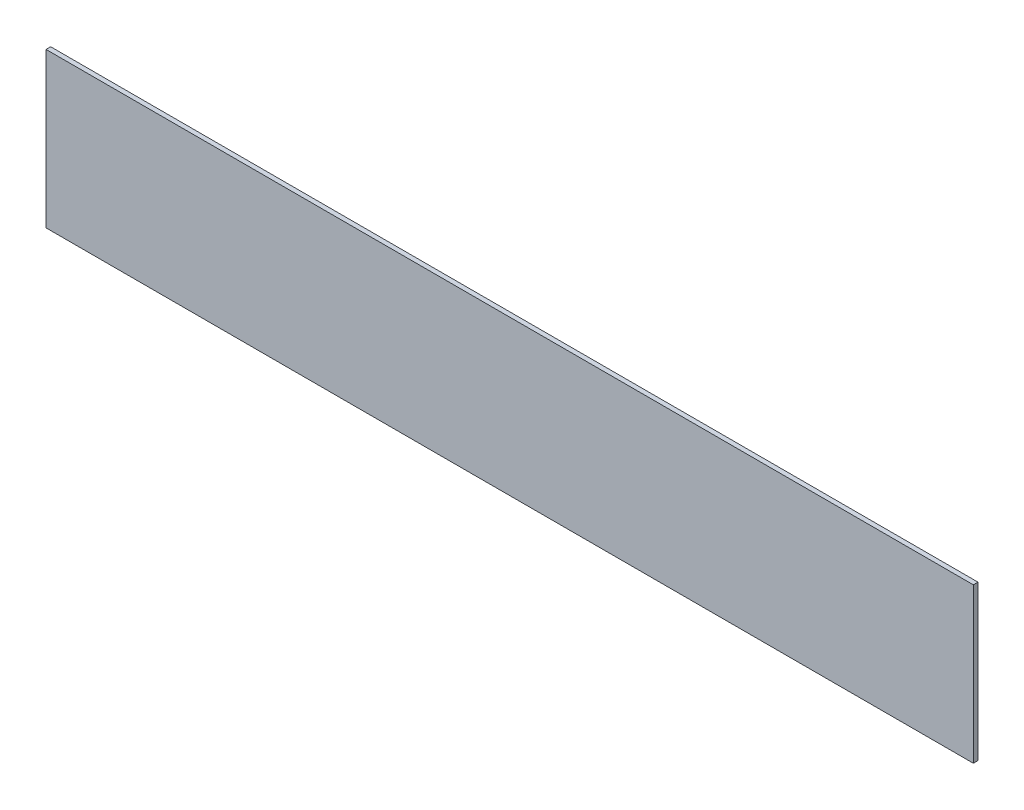
ISO-10303-21;
HEADER;
FILE_DESCRIPTION(('STEP AP214'),'2;1');
FILE_NAME('part.step','',(''),(''),'','','');
FILE_SCHEMA(('AUTOMOTIVE_DESIGN { 1 0 10303 214 1 1 1 1 }'));
ENDSEC;
DATA;
#1=APPLICATION_CONTEXT('core data for automotive mechanical design processes');
#2=APPLICATION_PROTOCOL_DEFINITION('international standard','automotive_design',2000,#1);
#3=PRODUCT_CONTEXT('',#1,'mechanical');
#4=PRODUCT('Part','Part','',(#3));
#5=PRODUCT_RELATED_PRODUCT_CATEGORY('part','',(#4));
#6=PRODUCT_DEFINITION_FORMATION('','',#4);
#7=PRODUCT_DEFINITION_CONTEXT('part definition',#1,'design');
#8=PRODUCT_DEFINITION('design','',#6,#7);
#9=PRODUCT_DEFINITION_SHAPE('','',#8);
#10=(LENGTH_UNIT() NAMED_UNIT(*) SI_UNIT(.MILLI.,.METRE.));
#11=(NAMED_UNIT(*) PLANE_ANGLE_UNIT() SI_UNIT($,.RADIAN.));
#12=(NAMED_UNIT(*) SI_UNIT($,.STERADIAN.) SOLID_ANGLE_UNIT());
#13=UNCERTAINTY_MEASURE_WITH_UNIT(LENGTH_MEASURE(1.E-05),#10,'distance_accuracy_value','');
#14=(GEOMETRIC_REPRESENTATION_CONTEXT(3) GLOBAL_UNCERTAINTY_ASSIGNED_CONTEXT((#13)) GLOBAL_UNIT_ASSIGNED_CONTEXT((#10,
#11,#12)) REPRESENTATION_CONTEXT('',''));
#15=CARTESIAN_POINT('',(0.,0.,0.));
#16=DIRECTION('',(0.,0.,1.));
#17=DIRECTION('',(1.,0.,0.));
#18=AXIS2_PLACEMENT_3D('',#15,#16,#17);
#19=CARTESIAN_POINT('',(0.,0.,3.));
#20=DIRECTION('',(1.,0.,0.));
#21=DIRECTION('',(0.,0.,-1.));
#22=AXIS2_PLACEMENT_3D('',#19,#20,#21);
#23=PLANE('',#22);
#24=DIRECTION('',(0.,-1.,0.));
#25=VECTOR('',#24,1.);
#26=CARTESIAN_POINT('',(0.,0.,0.));
#27=LINE('',#26,#25);
#28=CARTESIAN_POINT('',(0.,100.,0.));
#29=VERTEX_POINT('',#28);
#30=CARTESIAN_POINT('',(0.,0.,0.));
#31=VERTEX_POINT('',#30);
#32=EDGE_CURVE('E102',#29,#31,#27,.T.);
#33=ORIENTED_EDGE('',*,*,#32,.T.);
#34=DIRECTION('',(0.,0.,-1.));
#35=VECTOR('',#34,1.);
#36=CARTESIAN_POINT('',(0.,0.,3.));
#37=LINE('',#36,#35);
#38=CARTESIAN_POINT('',(0.,0.,3.));
#39=VERTEX_POINT('',#38);
#40=EDGE_CURVE('E11',#39,#31,#37,.T.);
#41=ORIENTED_EDGE('',*,*,#40,.F.);
#42=DIRECTION('',(0.,-1.,0.));
#43=VECTOR('',#42,1.);
#44=CARTESIAN_POINT('',(0.,0.,3.));
#45=LINE('',#44,#43);
#46=CARTESIAN_POINT('',(0.,100.,3.));
#47=VERTEX_POINT('',#46);
#48=EDGE_CURVE('E90',#47,#39,#45,.T.);
#49=ORIENTED_EDGE('',*,*,#48,.F.);
#50=DIRECTION('',(0.,0.,-1.));
#51=VECTOR('',#50,1.);
#52=CARTESIAN_POINT('',(0.,100.,3.));
#53=LINE('',#52,#51);
#54=EDGE_CURVE('E98',#47,#29,#53,.T.);
#55=ORIENTED_EDGE('',*,*,#54,.T.);
#56=EDGE_LOOP('',(#33,#41,#49,#55));
#57=FACE_BOUND('',#56,.T.);
#58=ADVANCED_FACE('F39',(#57),#23,.F.);
#59=CARTESIAN_POINT('',(0.,0.,3.));
#60=DIRECTION('',(0.,1.,0.));
#61=DIRECTION('',(0.,0.,1.));
#62=AXIS2_PLACEMENT_3D('',#59,#60,#61);
#63=PLANE('',#62);
#64=DIRECTION('',(1.,0.,0.));
#65=VECTOR('',#64,1.);
#66=CARTESIAN_POINT('',(0.,0.,0.));
#67=LINE('',#66,#65);
#68=CARTESIAN_POINT('',(600.,0.,0.));
#69=VERTEX_POINT('',#68);
#70=EDGE_CURVE('E94',#31,#69,#67,.T.);
#71=ORIENTED_EDGE('',*,*,#70,.T.);
#72=DIRECTION('',(0.,0.,-1.));
#73=VECTOR('',#72,1.);
#74=CARTESIAN_POINT('',(600.,0.,3.));
#75=LINE('',#74,#73);
#76=CARTESIAN_POINT('',(600.,0.,3.));
#77=VERTEX_POINT('',#76);
#78=EDGE_CURVE('E47',#77,#69,#75,.T.);
#79=ORIENTED_EDGE('',*,*,#78,.F.);
#80=DIRECTION('',(1.,0.,0.));
#81=VECTOR('',#80,1.);
#82=CARTESIAN_POINT('',(0.,0.,3.));
#83=LINE('',#82,#81);
#84=EDGE_CURVE('E85',#39,#77,#83,.T.);
#85=ORIENTED_EDGE('',*,*,#84,.F.);
#86=ORIENTED_EDGE('',*,*,#40,.T.);
#87=EDGE_LOOP('',(#71,#79,#85,#86));
#88=FACE_BOUND('',#87,.T.);
#89=ADVANCED_FACE('F93',(#88),#63,.F.);
#90=CARTESIAN_POINT('',(600.,0.,3.));
#91=DIRECTION('',(-1.,0.,0.));
#92=DIRECTION('',(0.,0.,1.));
#93=AXIS2_PLACEMENT_3D('',#90,#91,#92);
#94=PLANE('',#93);
#95=DIRECTION('',(0.,1.,0.));
#96=VECTOR('',#95,1.);
#97=CARTESIAN_POINT('',(600.,0.,0.));
#98=LINE('',#97,#96);
#99=CARTESIAN_POINT('',(600.,100.,0.));
#100=VERTEX_POINT('',#99);
#101=EDGE_CURVE('E72',#69,#100,#98,.T.);
#102=ORIENTED_EDGE('',*,*,#101,.T.);
#103=DIRECTION('',(0.,0.,-1.));
#104=VECTOR('',#103,1.);
#105=CARTESIAN_POINT('',(600.,100.,3.));
#106=LINE('',#105,#104);
#107=CARTESIAN_POINT('',(600.,100.,3.));
#108=VERTEX_POINT('',#107);
#109=EDGE_CURVE('E95',#108,#100,#106,.T.);
#110=ORIENTED_EDGE('',*,*,#109,.F.);
#111=DIRECTION('',(0.,1.,0.));
#112=VECTOR('',#111,1.);
#113=CARTESIAN_POINT('',(600.,0.,3.));
#114=LINE('',#113,#112);
#115=EDGE_CURVE('E88',#77,#108,#114,.T.);
#116=ORIENTED_EDGE('',*,*,#115,.F.);
#117=ORIENTED_EDGE('',*,*,#78,.T.);
#118=EDGE_LOOP('',(#102,#110,#116,#117));
#119=FACE_BOUND('',#118,.T.);
#120=ADVANCED_FACE('F96',(#119),#94,.F.);
#121=CARTESIAN_POINT('',(0.,100.,3.));
#122=DIRECTION('',(0.,-1.,0.));
#123=DIRECTION('',(0.,0.,-1.));
#124=AXIS2_PLACEMENT_3D('',#121,#122,#123);
#125=PLANE('',#124);
#126=DIRECTION('',(-1.,0.,0.));
#127=VECTOR('',#126,1.);
#128=CARTESIAN_POINT('',(0.,100.,0.));
#129=LINE('',#128,#127);
#130=EDGE_CURVE('E78',#100,#29,#129,.T.);
#131=ORIENTED_EDGE('',*,*,#130,.T.);
#132=ORIENTED_EDGE('',*,*,#54,.F.);
#133=DIRECTION('',(-1.,0.,0.));
#134=VECTOR('',#133,1.);
#135=CARTESIAN_POINT('',(0.,100.,3.));
#136=LINE('',#135,#134);
#137=EDGE_CURVE('E55',#108,#47,#136,.T.);
#138=ORIENTED_EDGE('',*,*,#137,.F.);
#139=ORIENTED_EDGE('',*,*,#109,.T.);
#140=EDGE_LOOP('',(#131,#132,#138,#139));
#141=FACE_BOUND('',#140,.T.);
#142=ADVANCED_FACE('F109',(#141),#125,.F.);
#143=CARTESIAN_POINT('',(0.,0.,3.));
#144=DIRECTION('',(0.,0.,-1.));
#145=DIRECTION('',(-1.,0.,0.));
#146=AXIS2_PLACEMENT_3D('',#143,#144,#145);
#147=PLANE('',#146);
#148=ORIENTED_EDGE('',*,*,#48,.T.);
#149=ORIENTED_EDGE('',*,*,#84,.T.);
#150=ORIENTED_EDGE('',*,*,#115,.T.);
#151=ORIENTED_EDGE('',*,*,#137,.T.);
#152=EDGE_LOOP('',(#148,#149,#150,#151));
#153=FACE_BOUND('',#152,.T.);
#154=ADVANCED_FACE('F86',(#153),#147,.F.);
#155=CARTESIAN_POINT('',(0.,0.,0.));
#156=DIRECTION('',(0.,0.,-1.));
#157=DIRECTION('',(-1.,0.,0.));
#158=AXIS2_PLACEMENT_3D('',#155,#156,#157);
#159=PLANE('',#158);
#160=ORIENTED_EDGE('',*,*,#32,.F.);
#161=ORIENTED_EDGE('',*,*,#130,.F.);
#162=ORIENTED_EDGE('',*,*,#101,.F.);
#163=ORIENTED_EDGE('',*,*,#70,.F.);
#164=EDGE_LOOP('',(#160,#161,#162,#163));
#165=FACE_BOUND('',#164,.T.);
#166=ADVANCED_FACE('F112',(#165),#159,.T.);
#167=CLOSED_SHELL('',(#58,#89,#120,#142,#154,#166));
#168=MANIFOLD_SOLID_BREP('B2',#167);
#169=ADVANCED_BREP_SHAPE_REPRESENTATION('',(#18,#168),#14);
#170=SHAPE_DEFINITION_REPRESENTATION(#9,#169);
ENDSEC;
END-ISO-10303-21;
